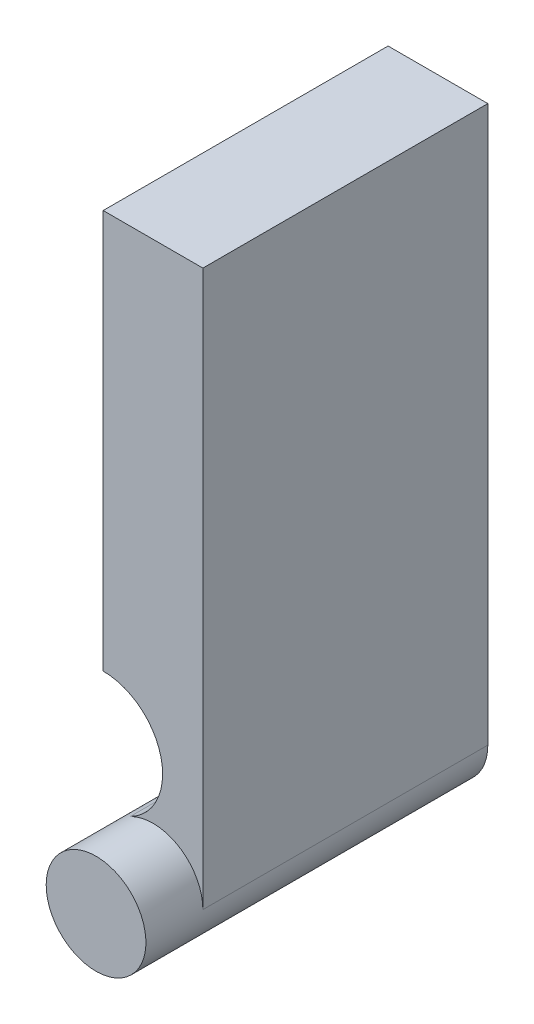
ISO-10303-21;
HEADER;
FILE_DESCRIPTION(('STEP AP214'),'2;1');
FILE_NAME('part.step','',(''),(''),'','','');
FILE_SCHEMA(('AUTOMOTIVE_DESIGN { 1 0 10303 214 1 1 1 1 }'));
ENDSEC;
DATA;
#1=APPLICATION_CONTEXT('core data for automotive mechanical design processes');
#2=APPLICATION_PROTOCOL_DEFINITION('international standard','automotive_design',2000,#1);
#3=PRODUCT_CONTEXT('',#1,'mechanical');
#4=PRODUCT('Part','Part','',(#3));
#5=PRODUCT_RELATED_PRODUCT_CATEGORY('part','',(#4));
#6=PRODUCT_DEFINITION_FORMATION('','',#4);
#7=PRODUCT_DEFINITION_CONTEXT('part definition',#1,'design');
#8=PRODUCT_DEFINITION('design','',#6,#7);
#9=PRODUCT_DEFINITION_SHAPE('','',#8);
#10=(LENGTH_UNIT() NAMED_UNIT(*) SI_UNIT(.MILLI.,.METRE.));
#11=(NAMED_UNIT(*) PLANE_ANGLE_UNIT() SI_UNIT($,.RADIAN.));
#12=(NAMED_UNIT(*) SI_UNIT($,.STERADIAN.) SOLID_ANGLE_UNIT());
#13=UNCERTAINTY_MEASURE_WITH_UNIT(LENGTH_MEASURE(1.E-05),#10,'distance_accuracy_value','');
#14=(GEOMETRIC_REPRESENTATION_CONTEXT(3) GLOBAL_UNCERTAINTY_ASSIGNED_CONTEXT((#13)) GLOBAL_UNIT_ASSIGNED_CONTEXT((#10,
#11,#12)) REPRESENTATION_CONTEXT('',''));
#15=CARTESIAN_POINT('',(0.,0.,0.));
#16=DIRECTION('',(0.,0.,1.));
#17=DIRECTION('',(1.,0.,0.));
#18=AXIS2_PLACEMENT_3D('',#15,#16,#17);
#19=CARTESIAN_POINT('',(0.,0.,10.));
#20=DIRECTION('',(0.,0.,-1.));
#21=DIRECTION('',(-1.,0.,0.));
#22=AXIS2_PLACEMENT_3D('',#19,#20,#21);
#23=CYLINDRICAL_SURFACE('',#22,1.75);
#24=CARTESIAN_POINT('',(0.,0.,0.));
#25=DIRECTION('',(0.,0.,1.));
#26=DIRECTION('',(1.,0.,0.));
#27=AXIS2_PLACEMENT_3D('',#24,#25,#26);
#28=CIRCLE('',#27,1.75);
#29=CARTESIAN_POINT('',(-0.798314606741572,1.55730337078652,0.));
#30=VERTEX_POINT('',#29);
#31=CARTESIAN_POINT('',(1.75,0.,0.));
#32=VERTEX_POINT('',#31);
#33=EDGE_CURVE('E105',#30,#32,#28,.T.);
#34=ORIENTED_EDGE('',*,*,#33,.T.);
#35=DIRECTION('',(0.,0.,-1.));
#36=VECTOR('',#35,1.);
#37=CARTESIAN_POINT('',(1.75,0.,10.));
#38=LINE('',#37,#36);
#39=CARTESIAN_POINT('',(1.75,0.,10.));
#40=VERTEX_POINT('',#39);
#41=EDGE_CURVE('E13',#40,#32,#38,.T.);
#42=ORIENTED_EDGE('',*,*,#41,.F.);
#43=CARTESIAN_POINT('',(0.,0.,10.));
#44=DIRECTION('',(0.,0.,1.));
#45=DIRECTION('',(1.,0.,0.));
#46=AXIS2_PLACEMENT_3D('',#43,#44,#45);
#47=CIRCLE('',#46,1.75);
#48=CARTESIAN_POINT('',(-0.798314606741572,1.55730337078652,10.));
#49=VERTEX_POINT('',#48);
#50=EDGE_CURVE('E103',#40,#49,#47,.T.);
#51=ORIENTED_EDGE('',*,*,#50,.T.);
#52=DIRECTION('',(0.,0.,-1.));
#53=VECTOR('',#52,1.);
#54=CARTESIAN_POINT('',(-0.798314606741572,1.55730337078652,10.));
#55=LINE('',#54,#53);
#56=EDGE_CURVE('E123',#49,#30,#55,.T.);
#57=ORIENTED_EDGE('',*,*,#56,.T.);
#58=EDGE_LOOP('',(#34,#42,#51,#57));
#59=FACE_BOUND('',#58,.T.);
#60=CARTESIAN_POINT('',(0.,0.,12.));
#61=DIRECTION('',(0.,0.,-1.));
#62=DIRECTION('',(-1.,0.,0.));
#63=AXIS2_PLACEMENT_3D('',#60,#61,#62);
#64=CIRCLE('',#63,1.75);
#65=CARTESIAN_POINT('',(-1.75,0.,12.));
#66=VERTEX_POINT('',#65);
#67=EDGE_CURVE('E113',#66,#66,#64,.T.);
#68=ORIENTED_EDGE('',*,*,#67,.T.);
#69=EDGE_LOOP('',(#68));
#70=FACE_BOUND('',#69,.T.);
#71=ADVANCED_FACE('F46',(#59,#70),#23,.T.);
#72=CARTESIAN_POINT('',(1.75,0.,10.));
#73=DIRECTION('',(-1.,0.,0.));
#74=DIRECTION('',(0.,-1.,0.));
#75=AXIS2_PLACEMENT_3D('',#72,#73,#74);
#76=PLANE('',#75);
#77=DIRECTION('',(0.,1.,0.));
#78=VECTOR('',#77,1.);
#79=CARTESIAN_POINT('',(1.75,0.,0.));
#80=LINE('',#79,#78);
#81=CARTESIAN_POINT('',(1.75,19.5,0.));
#82=VERTEX_POINT('',#81);
#83=EDGE_CURVE('E115',#32,#82,#80,.T.);
#84=ORIENTED_EDGE('',*,*,#83,.T.);
#85=DIRECTION('',(0.,0.,-1.));
#86=VECTOR('',#85,1.);
#87=CARTESIAN_POINT('',(1.75,19.5,10.));
#88=LINE('',#87,#86);
#89=CARTESIAN_POINT('',(1.75,19.5,10.));
#90=VERTEX_POINT('',#89);
#91=EDGE_CURVE('E54',#90,#82,#88,.T.);
#92=ORIENTED_EDGE('',*,*,#91,.F.);
#93=DIRECTION('',(0.,1.,0.));
#94=VECTOR('',#93,1.);
#95=CARTESIAN_POINT('',(1.75,0.,10.));
#96=LINE('',#95,#94);
#97=EDGE_CURVE('E95',#40,#90,#96,.T.);
#98=ORIENTED_EDGE('',*,*,#97,.F.);
#99=ORIENTED_EDGE('',*,*,#41,.T.);
#100=EDGE_LOOP('',(#84,#92,#98,#99));
#101=FACE_BOUND('',#100,.T.);
#102=ADVANCED_FACE('F107',(#101),#76,.F.);
#103=CARTESIAN_POINT('',(-1.75,19.5,10.));
#104=DIRECTION('',(0.,-1.,0.));
#105=DIRECTION('',(0.,0.,-1.));
#106=AXIS2_PLACEMENT_3D('',#103,#104,#105);
#107=PLANE('',#106);
#108=DIRECTION('',(-1.,0.,0.));
#109=VECTOR('',#108,1.);
#110=CARTESIAN_POINT('',(-1.75,19.5,0.));
#111=LINE('',#110,#109);
#112=CARTESIAN_POINT('',(-1.75,19.5,0.));
#113=VERTEX_POINT('',#112);
#114=EDGE_CURVE('E126',#82,#113,#111,.T.);
#115=ORIENTED_EDGE('',*,*,#114,.T.);
#116=DIRECTION('',(0.,0.,-1.));
#117=VECTOR('',#116,1.);
#118=CARTESIAN_POINT('',(-1.75,19.5,10.));
#119=LINE('',#118,#117);
#120=CARTESIAN_POINT('',(-1.75,19.5,10.));
#121=VERTEX_POINT('',#120);
#122=EDGE_CURVE('E133',#121,#113,#119,.T.);
#123=ORIENTED_EDGE('',*,*,#122,.F.);
#124=DIRECTION('',(-1.,0.,0.));
#125=VECTOR('',#124,1.);
#126=CARTESIAN_POINT('',(-1.75,19.5,10.));
#127=LINE('',#126,#125);
#128=EDGE_CURVE('E110',#90,#121,#127,.T.);
#129=ORIENTED_EDGE('',*,*,#128,.F.);
#130=ORIENTED_EDGE('',*,*,#91,.T.);
#131=EDGE_LOOP('',(#115,#123,#129,#130));
#132=FACE_BOUND('',#131,.T.);
#133=ADVANCED_FACE('F136',(#132),#107,.F.);
#134=CARTESIAN_POINT('',(-1.75,19.5,10.));
#135=DIRECTION('',(1.,0.,0.));
#136=DIRECTION('',(0.,1.,0.));
#137=AXIS2_PLACEMENT_3D('',#134,#135,#136);
#138=PLANE('',#137);
#139=DIRECTION('',(0.,-1.,0.));
#140=VECTOR('',#139,1.);
#141=CARTESIAN_POINT('',(-1.75,19.5,0.));
#142=LINE('',#141,#140);
#143=CARTESIAN_POINT('',(-1.75,5.5,0.));
#144=VERTEX_POINT('',#143);
#145=EDGE_CURVE('E83',#113,#144,#142,.T.);
#146=ORIENTED_EDGE('',*,*,#145,.T.);
#147=DIRECTION('',(0.,0.,-1.));
#148=VECTOR('',#147,1.);
#149=CARTESIAN_POINT('',(-1.75,5.5,10.));
#150=LINE('',#149,#148);
#151=CARTESIAN_POINT('',(-1.75,5.5,10.));
#152=VERTEX_POINT('',#151);
#153=EDGE_CURVE('E131',#152,#144,#150,.T.);
#154=ORIENTED_EDGE('',*,*,#153,.F.);
#155=DIRECTION('',(0.,-1.,0.));
#156=VECTOR('',#155,1.);
#157=CARTESIAN_POINT('',(-1.75,19.5,10.));
#158=LINE('',#157,#156);
#159=EDGE_CURVE('E121',#121,#152,#158,.T.);
#160=ORIENTED_EDGE('',*,*,#159,.F.);
#161=ORIENTED_EDGE('',*,*,#122,.T.);
#162=EDGE_LOOP('',(#146,#154,#160,#161));
#163=FACE_BOUND('',#162,.T.);
#164=ADVANCED_FACE('F159',(#163),#138,.F.);
#165=CARTESIAN_POINT('',(-1.75,3.41379310344828,10.));
#166=DIRECTION('',(0.,0.,-1.));
#167=DIRECTION('',(-1.,0.,0.));
#168=AXIS2_PLACEMENT_3D('',#165,#166,#167);
#169=CYLINDRICAL_SURFACE('',#168,2.08620689655172);
#170=CARTESIAN_POINT('',(-1.75,3.41379310344828,0.));
#171=DIRECTION('',(0.,0.,-1.));
#172=DIRECTION('',(-1.,0.,0.));
#173=AXIS2_PLACEMENT_3D('',#170,#171,#172);
#174=CIRCLE('',#173,2.08620689655172);
#175=EDGE_CURVE('E89',#144,#30,#174,.T.);
#176=ORIENTED_EDGE('',*,*,#175,.T.);
#177=ORIENTED_EDGE('',*,*,#56,.F.);
#178=CARTESIAN_POINT('',(-1.75,3.41379310344828,10.));
#179=DIRECTION('',(0.,0.,-1.));
#180=DIRECTION('',(-1.,0.,0.));
#181=AXIS2_PLACEMENT_3D('',#178,#179,#180);
#182=CIRCLE('',#181,2.08620689655172);
#183=EDGE_CURVE('E62',#152,#49,#182,.T.);
#184=ORIENTED_EDGE('',*,*,#183,.F.);
#185=ORIENTED_EDGE('',*,*,#153,.T.);
#186=EDGE_LOOP('',(#176,#177,#184,#185));
#187=FACE_BOUND('',#186,.T.);
#188=ADVANCED_FACE('F149',(#187),#169,.F.);
#189=CARTESIAN_POINT('',(0.,0.,10.));
#190=DIRECTION('',(0.,0.,1.));
#191=DIRECTION('',(1.,0.,0.));
#192=AXIS2_PLACEMENT_3D('',#189,#190,#191);
#193=PLANE('',#192);
#194=ORIENTED_EDGE('',*,*,#50,.F.);
#195=ORIENTED_EDGE('',*,*,#97,.T.);
#196=ORIENTED_EDGE('',*,*,#128,.T.);
#197=ORIENTED_EDGE('',*,*,#159,.T.);
#198=ORIENTED_EDGE('',*,*,#183,.T.);
#199=EDGE_LOOP('',(#194,#195,#196,#197,#198));
#200=FACE_BOUND('',#199,.T.);
#201=ADVANCED_FACE('F112',(#200),#193,.T.);
#202=CARTESIAN_POINT('',(0.,0.,0.));
#203=DIRECTION('',(0.,0.,1.));
#204=DIRECTION('',(1.,0.,0.));
#205=AXIS2_PLACEMENT_3D('',#202,#203,#204);
#206=PLANE('',#205);
#207=ORIENTED_EDGE('',*,*,#83,.F.);
#208=ORIENTED_EDGE('',*,*,#33,.F.);
#209=ORIENTED_EDGE('',*,*,#175,.F.);
#210=ORIENTED_EDGE('',*,*,#145,.F.);
#211=ORIENTED_EDGE('',*,*,#114,.F.);
#212=EDGE_LOOP('',(#207,#208,#209,#210,#211));
#213=FACE_BOUND('',#212,.T.);
#214=ADVANCED_FACE('F139',(#213),#206,.F.);
#215=CARTESIAN_POINT('',(0.,0.,12.));
#216=DIRECTION('',(0.,0.,-1.));
#217=DIRECTION('',(-1.,0.,0.));
#218=AXIS2_PLACEMENT_3D('',#215,#216,#217);
#219=PLANE('',#218);
#220=ORIENTED_EDGE('',*,*,#67,.F.);
#221=EDGE_LOOP('',(#220));
#222=FACE_BOUND('',#221,.T.);
#223=ADVANCED_FACE('F141',(#222),#219,.F.);
#224=CLOSED_SHELL('',(#71,#102,#133,#164,#188,#201,#214,#223));
#225=MANIFOLD_SOLID_BREP('B2',#224);
#226=ADVANCED_BREP_SHAPE_REPRESENTATION('',(#18,#225),#14);
#227=SHAPE_DEFINITION_REPRESENTATION(#9,#226);
ENDSEC;
END-ISO-10303-21;
